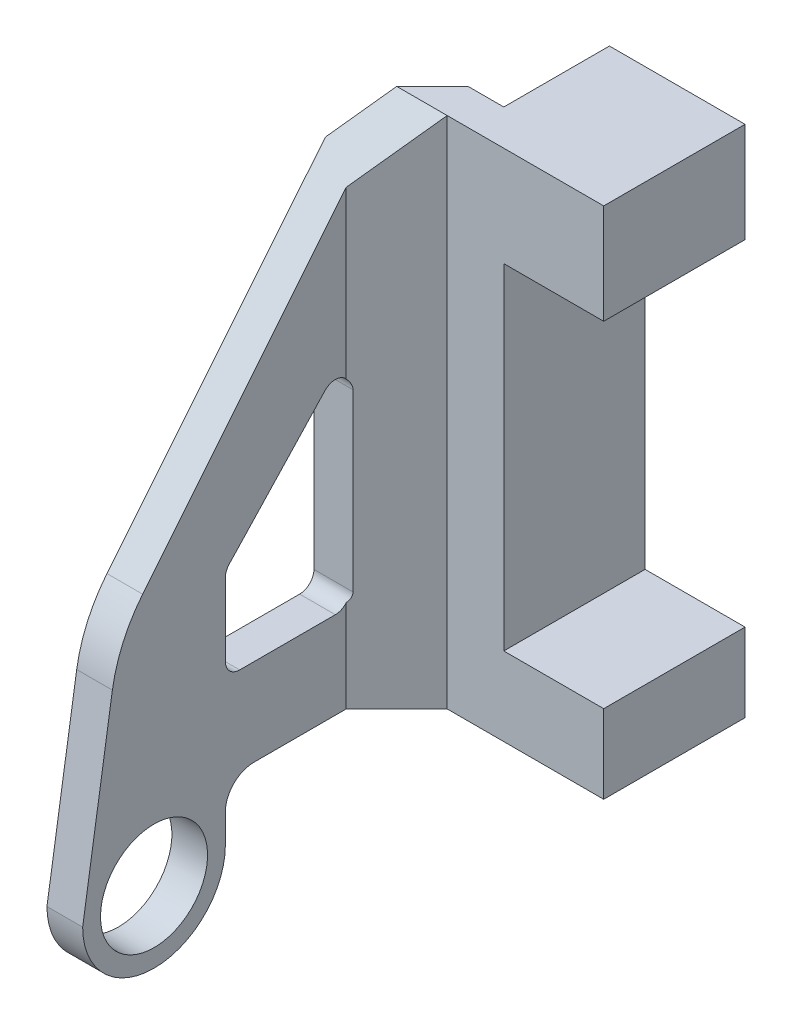
ISO-10303-21;
HEADER;
FILE_DESCRIPTION(('STEP AP214'),'2;1');
FILE_NAME('part.step','',(''),(''),'','','');
FILE_SCHEMA(('AUTOMOTIVE_DESIGN { 1 0 10303 214 1 1 1 1 }'));
ENDSEC;
DATA;
#1=APPLICATION_CONTEXT('core data for automotive mechanical design processes');
#2=APPLICATION_PROTOCOL_DEFINITION('international standard','automotive_design',2000,#1);
#3=PRODUCT_CONTEXT('',#1,'mechanical');
#4=PRODUCT('Part','Part','',(#3));
#5=PRODUCT_RELATED_PRODUCT_CATEGORY('part','',(#4));
#6=PRODUCT_DEFINITION_FORMATION('','',#4);
#7=PRODUCT_DEFINITION_CONTEXT('part definition',#1,'design');
#8=PRODUCT_DEFINITION('design','',#6,#7);
#9=PRODUCT_DEFINITION_SHAPE('','',#8);
#10=(LENGTH_UNIT() NAMED_UNIT(*) SI_UNIT(.MILLI.,.METRE.));
#11=(NAMED_UNIT(*) PLANE_ANGLE_UNIT() SI_UNIT($,.RADIAN.));
#12=(NAMED_UNIT(*) SI_UNIT($,.STERADIAN.) SOLID_ANGLE_UNIT());
#13=UNCERTAINTY_MEASURE_WITH_UNIT(LENGTH_MEASURE(1.E-05),#10,'distance_accuracy_value','');
#14=(GEOMETRIC_REPRESENTATION_CONTEXT(3) GLOBAL_UNCERTAINTY_ASSIGNED_CONTEXT((#13)) GLOBAL_UNIT_ASSIGNED_CONTEXT((#10,
#11,#12)) REPRESENTATION_CONTEXT('',''));
#15=CARTESIAN_POINT('',(0.,0.,0.));
#16=DIRECTION('',(0.,0.,1.));
#17=DIRECTION('',(1.,0.,0.));
#18=AXIS2_PLACEMENT_3D('',#15,#16,#17);
#19=CARTESIAN_POINT('',(-17.,-4.,26.9));
#20=DIRECTION('',(-1.,0.,0.));
#21=DIRECTION('',(0.,0.,1.));
#22=AXIS2_PLACEMENT_3D('',#19,#20,#21);
#23=PLANE('',#22);
#24=CARTESIAN_POINT('',(-17.,-4.,26.9));
#25=DIRECTION('',(-1.,0.,0.));
#26=DIRECTION('',(0.,0.,1.));
#27=AXIS2_PLACEMENT_3D('',#24,#25,#26);
#28=CIRCLE('',#27,3.75);
#29=CARTESIAN_POINT('',(-17.,-4.,30.65));
#30=VERTEX_POINT('',#29);
#31=EDGE_CURVE('E778',#30,#30,#28,.T.);
#32=ORIENTED_EDGE('',*,*,#31,.F.);
#33=EDGE_LOOP('',(#32));
#34=FACE_BOUND('',#33,.T.);
#35=DIRECTION('',(0.,0.988012033751101,-0.15437688027361));
#36=VECTOR('',#35,1.);
#37=CARTESIAN_POINT('',(-17.,-4.,31.9));
#38=LINE('',#37,#36);
#39=CARTESIAN_POINT('',(-17.,-4.,31.9));
#40=VERTEX_POINT('',#39);
#41=CARTESIAN_POINT('',(-17.,9.33291795760597,29.8167315691241));
#42=VERTEX_POINT('',#41);
#43=EDGE_CURVE('E314',#40,#42,#38,.T.);
#44=ORIENTED_EDGE('',*,*,#43,.T.);
#45=CARTESIAN_POINT('',(-17.,7.78914915486987,19.9366112316131));
#46=DIRECTION('',(-1.,0.,0.));
#47=DIRECTION('',(0.,0.,1.));
#48=AXIS2_PLACEMENT_3D('',#45,#46,#47);
#49=CIRCLE('',#48,10.);
#50=CARTESIAN_POINT('',(-17.,14.0950754058145,27.6977512327757));
#51=VERTEX_POINT('',#50);
#52=EDGE_CURVE('E369',#42,#51,#49,.T.);
#53=ORIENTED_EDGE('',*,*,#52,.T.);
#54=DIRECTION('',(0.,0.776114000116266,-0.630592625094466));
#55=VECTOR('',#54,1.);
#56=CARTESIAN_POINT('',(-17.,12.,29.4));
#57=LINE('',#56,#55);
#58=CARTESIAN_POINT('',(-17.,32.923076923077,12.3999999999999));
#59=VERTEX_POINT('',#58);
#60=EDGE_CURVE('E317',#51,#59,#57,.T.);
#61=ORIENTED_EDGE('',*,*,#60,.T.);
#62=DIRECTION('',(0.,1.,0.));
#63=VECTOR('',#62,1.);
#64=CARTESIAN_POINT('',(-17.,-4.,12.3999999999999));
#65=LINE('',#64,#63);
#66=CARTESIAN_POINT('',(-17.,0.,12.3999999999999));
#67=VERTEX_POINT('',#66);
#68=EDGE_CURVE('E301',#67,#59,#65,.T.);
#69=ORIENTED_EDGE('',*,*,#68,.F.);
#70=DIRECTION('',(0.,0.,1.));
#71=VECTOR('',#70,1.);
#72=CARTESIAN_POINT('',(-17.,0.,7.4));
#73=LINE('',#72,#71);
#74=CARTESIAN_POINT('',(-17.,0.,19.9));
#75=VERTEX_POINT('',#74);
#76=EDGE_CURVE('E308',#67,#75,#73,.T.);
#77=ORIENTED_EDGE('',*,*,#76,.T.);
#78=CARTESIAN_POINT('',(-17.,-2.,19.9));
#79=DIRECTION('',(-1.,0.,0.));
#80=DIRECTION('',(0.,0.,1.));
#81=AXIS2_PLACEMENT_3D('',#78,#79,#80);
#82=CIRCLE('',#81,2.);
#83=CARTESIAN_POINT('',(-17.,-2.,21.9));
#84=VERTEX_POINT('',#83);
#85=EDGE_CURVE('E11',#75,#84,#82,.F.);
#86=ORIENTED_EDGE('',*,*,#85,.T.);
#87=DIRECTION('',(0.,-1.,0.));
#88=VECTOR('',#87,1.);
#89=CARTESIAN_POINT('',(-17.,0.,21.9));
#90=LINE('',#89,#88);
#91=CARTESIAN_POINT('',(-17.,-4.,21.9));
#92=VERTEX_POINT('',#91);
#93=EDGE_CURVE('E310',#84,#92,#90,.T.);
#94=ORIENTED_EDGE('',*,*,#93,.T.);
#95=CARTESIAN_POINT('',(-17.,-4.,26.9));
#96=DIRECTION('',(-1.,0.,0.));
#97=DIRECTION('',(0.,0.,1.));
#98=AXIS2_PLACEMENT_3D('',#95,#96,#97);
#99=CIRCLE('',#98,5.);
#100=EDGE_CURVE('E312',#92,#40,#99,.T.);
#101=ORIENTED_EDGE('',*,*,#100,.T.);
#102=EDGE_LOOP('',(#44,#53,#61,#69,#77,#86,#94,#101));
#103=FACE_BOUND('',#102,.T.);
#104=CARTESIAN_POINT('',(-17.,19.3672423947041,14.2));
#105=DIRECTION('',(-1.,0.,0.));
#106=DIRECTION('',(0.,0.,1.));
#107=AXIS2_PLACEMENT_3D('',#104,#105,#106);
#108=CIRCLE('',#107,1.);
#109=CARTESIAN_POINT('',(-17.,20.0503995234798,14.9302714135189));
#110=VERTEX_POINT('',#109);
#111=CARTESIAN_POINT('',(-17.,19.3672423947041,13.2));
#112=VERTEX_POINT('',#111);
#113=EDGE_CURVE('E232',#110,#112,#108,.T.);
#114=ORIENTED_EDGE('',*,*,#113,.F.);
#115=DIRECTION('',(0.,-0.730271413518896,0.683157128775741));
#116=VECTOR('',#115,1.);
#117=CARTESIAN_POINT('',(-17.,16.8061598224195,17.965205327414));
#118=LINE('',#117,#116);
#119=CARTESIAN_POINT('',(-17.,12.8883305579626,21.6302714135189));
#120=VERTEX_POINT('',#119);
#121=EDGE_CURVE('E237',#110,#120,#118,.T.);
#122=ORIENTED_EDGE('',*,*,#121,.T.);
#123=CARTESIAN_POINT('',(-17.,12.2051734291868,20.9));
#124=DIRECTION('',(-1.,0.,0.));
#125=DIRECTION('',(0.,0.,1.));
#126=AXIS2_PLACEMENT_3D('',#123,#124,#125);
#127=CIRCLE('',#126,1.);
#128=CARTESIAN_POINT('',(-17.,12.2051734291868,21.9));
#129=VERTEX_POINT('',#128);
#130=EDGE_CURVE('E254',#129,#120,#127,.T.);
#131=ORIENTED_EDGE('',*,*,#130,.F.);
#132=DIRECTION('',(0.,-1.,0.));
#133=VECTOR('',#132,1.);
#134=CARTESIAN_POINT('',(-17.,0.,21.9));
#135=LINE('',#134,#133);
#136=CARTESIAN_POINT('',(-17.,7.1,21.9));
#137=VERTEX_POINT('',#136);
#138=EDGE_CURVE('E251',#129,#137,#135,.T.);
#139=ORIENTED_EDGE('',*,*,#138,.T.);
#140=CARTESIAN_POINT('',(-17.,7.1,20.9));
#141=DIRECTION('',(-1.,0.,0.));
#142=DIRECTION('',(0.,0.,1.));
#143=AXIS2_PLACEMENT_3D('',#140,#141,#142);
#144=CIRCLE('',#143,1.);
#145=CARTESIAN_POINT('',(-17.,6.1,20.9));
#146=VERTEX_POINT('',#145);
#147=EDGE_CURVE('E248',#146,#137,#144,.T.);
#148=ORIENTED_EDGE('',*,*,#147,.F.);
#149=DIRECTION('',(0.,0.,-1.));
#150=VECTOR('',#149,1.);
#151=CARTESIAN_POINT('',(-17.,6.1,0.));
#152=LINE('',#151,#150);
#153=CARTESIAN_POINT('',(-17.,6.09999999999999,14.2));
#154=VERTEX_POINT('',#153);
#155=EDGE_CURVE('E243',#146,#154,#152,.T.);
#156=ORIENTED_EDGE('',*,*,#155,.T.);
#157=CARTESIAN_POINT('',(-17.,7.1,14.2));
#158=DIRECTION('',(-1.,0.,0.));
#159=DIRECTION('',(0.,0.,1.));
#160=AXIS2_PLACEMENT_3D('',#157,#158,#159);
#161=CIRCLE('',#160,1.);
#162=CARTESIAN_POINT('',(-17.,7.1,13.2));
#163=VERTEX_POINT('',#162);
#164=EDGE_CURVE('E241',#163,#154,#161,.T.);
#165=ORIENTED_EDGE('',*,*,#164,.F.);
#166=DIRECTION('',(0.,1.,0.));
#167=VECTOR('',#166,1.);
#168=CARTESIAN_POINT('',(-17.,0.,13.2));
#169=LINE('',#168,#167);
#170=EDGE_CURVE('E221',#163,#112,#169,.T.);
#171=ORIENTED_EDGE('',*,*,#170,.T.);
#172=EDGE_LOOP('',(#114,#122,#131,#139,#148,#156,#165,#171));
#173=FACE_BOUND('',#172,.T.);
#174=ADVANCED_FACE('F34',(#34,#103,#173),#23,.T.);
#175=CARTESIAN_POINT('',(-9.5,36.,9.9));
#176=DIRECTION('',(1.,0.,0.));
#177=DIRECTION('',(0.,0.,-1.));
#178=AXIS2_PLACEMENT_3D('',#175,#176,#177);
#179=PLANE('',#178);
#180=DIRECTION('',(0.,-1.,0.));
#181=VECTOR('',#180,1.);
#182=CARTESIAN_POINT('',(-9.5,0.,7.4));
#183=LINE('',#182,#181);
#184=CARTESIAN_POINT('',(-9.5,36.,7.4));
#185=VERTEX_POINT('',#184);
#186=CARTESIAN_POINT('',(-9.5,0.,7.4));
#187=VERTEX_POINT('',#186);
#188=EDGE_CURVE('E307',#185,#187,#183,.T.);
#189=ORIENTED_EDGE('',*,*,#188,.F.);
#190=DIRECTION('',(0.,0.,-1.));
#191=VECTOR('',#190,1.);
#192=CARTESIAN_POINT('',(-9.5,36.,9.9));
#193=LINE('',#192,#191);
#194=CARTESIAN_POINT('',(-9.5,36.,0.));
#195=VERTEX_POINT('',#194);
#196=EDGE_CURVE('E447',#185,#195,#193,.T.);
#197=ORIENTED_EDGE('',*,*,#196,.T.);
#198=DIRECTION('',(0.,-1.,0.));
#199=VECTOR('',#198,1.);
#200=CARTESIAN_POINT('',(-9.5,36.,0.));
#201=LINE('',#200,#199);
#202=CARTESIAN_POINT('',(-9.5,0.,0.));
#203=VERTEX_POINT('',#202);
#204=EDGE_CURVE('E438',#195,#203,#201,.T.);
#205=ORIENTED_EDGE('',*,*,#204,.T.);
#206=DIRECTION('',(0.,0.,-1.));
#207=VECTOR('',#206,1.);
#208=CARTESIAN_POINT('',(-9.5,0.,9.9));
#209=LINE('',#208,#207);
#210=EDGE_CURVE('E428',#187,#203,#209,.T.);
#211=ORIENTED_EDGE('',*,*,#210,.F.);
#212=EDGE_LOOP('',(#189,#197,#205,#211));
#213=FACE_BOUND('',#212,.T.);
#214=ADVANCED_FACE('F480',(#213),#179,.F.);
#215=CARTESIAN_POINT('',(0.,0.,9.9));
#216=DIRECTION('',(-1.,0.,0.));
#217=DIRECTION('',(0.,-1.,0.));
#218=AXIS2_PLACEMENT_3D('',#215,#216,#217);
#219=PLANE('',#218);
#220=DIRECTION('',(0.,1.,0.));
#221=VECTOR('',#220,1.);
#222=CARTESIAN_POINT('',(0.,0.,0.));
#223=LINE('',#222,#221);
#224=CARTESIAN_POINT('',(0.,0.,0.));
#225=VERTEX_POINT('',#224);
#226=CARTESIAN_POINT('',(0.,5.5,0.));
#227=VERTEX_POINT('',#226);
#228=EDGE_CURVE('E432',#225,#227,#223,.T.);
#229=ORIENTED_EDGE('',*,*,#228,.T.);
#230=DIRECTION('',(0.,0.,1.));
#231=VECTOR('',#230,1.);
#232=CARTESIAN_POINT('',(0.,5.5,0.));
#233=LINE('',#232,#231);
#234=CARTESIAN_POINT('',(0.,5.5,9.9));
#235=VERTEX_POINT('',#234);
#236=EDGE_CURVE('E412',#227,#235,#233,.T.);
#237=ORIENTED_EDGE('',*,*,#236,.T.);
#238=DIRECTION('',(0.,1.,0.));
#239=VECTOR('',#238,1.);
#240=CARTESIAN_POINT('',(0.,0.,9.9));
#241=LINE('',#240,#239);
#242=CARTESIAN_POINT('',(0.,0.,9.9));
#243=VERTEX_POINT('',#242);
#244=EDGE_CURVE('E422',#243,#235,#241,.T.);
#245=ORIENTED_EDGE('',*,*,#244,.F.);
#246=DIRECTION('',(0.,0.,-1.));
#247=VECTOR('',#246,1.);
#248=CARTESIAN_POINT('',(0.,0.,9.9));
#249=LINE('',#248,#247);
#250=EDGE_CURVE('E448',#243,#225,#249,.T.);
#251=ORIENTED_EDGE('',*,*,#250,.T.);
#252=EDGE_LOOP('',(#229,#237,#245,#251));
#253=FACE_BOUND('',#252,.T.);
#254=ADVANCED_FACE('F511',(#253),#219,.F.);
#255=CARTESIAN_POINT('',(-9.5,0.,9.9));
#256=DIRECTION('',(0.,1.,0.));
#257=DIRECTION('',(0.,0.,1.));
#258=AXIS2_PLACEMENT_3D('',#255,#256,#257);
#259=PLANE('',#258);
#260=DIRECTION('',(0.,0.,1.));
#261=VECTOR('',#260,1.);
#262=CARTESIAN_POINT('',(-14.5,0.,9.9));
#263=LINE('',#262,#261);
#264=CARTESIAN_POINT('',(-14.5,0.,13.4355339059327));
#265=VERTEX_POINT('',#264);
#266=CARTESIAN_POINT('',(-14.5,0.,19.9));
#267=VERTEX_POINT('',#266);
#268=EDGE_CURVE('E291',#265,#267,#263,.T.);
#269=ORIENTED_EDGE('',*,*,#268,.T.);
#270=DIRECTION('',(1.,0.,0.));
#271=VECTOR('',#270,1.);
#272=CARTESIAN_POINT('',(-17.,0.,19.9));
#273=LINE('',#272,#271);
#274=EDGE_CURVE('E50',#267,#75,#273,.F.);
#275=ORIENTED_EDGE('',*,*,#274,.T.);
#276=ORIENTED_EDGE('',*,*,#76,.F.);
#277=DIRECTION('',(0.707106781186551,0.,-0.707106781186544));
#278=VECTOR('',#277,1.);
#279=CARTESIAN_POINT('',(-12.,0.,7.39999999999999));
#280=LINE('',#279,#278);
#281=CARTESIAN_POINT('',(-12.,0.,7.4));
#282=VERTEX_POINT('',#281);
#283=EDGE_CURVE('E304',#67,#282,#280,.T.);
#284=ORIENTED_EDGE('',*,*,#283,.T.);
#285=DIRECTION('',(1.,0.,0.));
#286=VECTOR('',#285,1.);
#287=CARTESIAN_POINT('',(-17.,0.,7.4));
#288=LINE('',#287,#286);
#289=EDGE_CURVE('E337',#282,#187,#288,.T.);
#290=ORIENTED_EDGE('',*,*,#289,.T.);
#291=ORIENTED_EDGE('',*,*,#210,.T.);
#292=DIRECTION('',(1.,0.,0.));
#293=VECTOR('',#292,1.);
#294=CARTESIAN_POINT('',(-9.5,0.,0.));
#295=LINE('',#294,#293);
#296=EDGE_CURVE('E415',#203,#225,#295,.T.);
#297=ORIENTED_EDGE('',*,*,#296,.T.);
#298=ORIENTED_EDGE('',*,*,#250,.F.);
#299=DIRECTION('',(1.,0.,0.));
#300=VECTOR('',#299,1.);
#301=CARTESIAN_POINT('',(-9.5,0.,9.9));
#302=LINE('',#301,#300);
#303=CARTESIAN_POINT('',(-10.9644660940673,0.,9.9));
#304=VERTEX_POINT('',#303);
#305=EDGE_CURVE('E332',#304,#243,#302,.T.);
#306=ORIENTED_EDGE('',*,*,#305,.F.);
#307=DIRECTION('',(-0.707106781186551,0.,0.707106781186544));
#308=VECTOR('',#307,1.);
#309=CARTESIAN_POINT('',(-10.2322330470336,0.,9.16776695296636));
#310=LINE('',#309,#308);
#311=EDGE_CURVE('E293',#304,#265,#310,.T.);
#312=ORIENTED_EDGE('',*,*,#311,.T.);
#313=EDGE_LOOP('',(#269,#275,#276,#284,#290,#291,#297,#298,#306,#312));
#314=FACE_BOUND('',#313,.T.);
#315=ADVANCED_FACE('F483',(#314),#259,.F.);
#316=CARTESIAN_POINT('',(0.,29.,9.9));
#317=VERTEX_POINT('',#316);
#318=CARTESIAN_POINT('',(0.,36.,9.9));
#319=VERTEX_POINT('',#318);
#320=EDGE_CURVE('E426',#317,#319,#241,.T.);
#321=ORIENTED_EDGE('',*,*,#320,.F.);
#322=DIRECTION('',(0.,0.,1.));
#323=VECTOR('',#322,1.);
#324=CARTESIAN_POINT('',(0.,29.,0.));
#325=LINE('',#324,#323);
#326=CARTESIAN_POINT('',(0.,29.,0.));
#327=VERTEX_POINT('',#326);
#328=EDGE_CURVE('E406',#327,#317,#325,.T.);
#329=ORIENTED_EDGE('',*,*,#328,.F.);
#330=CARTESIAN_POINT('',(0.,36.,0.));
#331=VERTEX_POINT('',#330);
#332=EDGE_CURVE('E431',#327,#331,#223,.T.);
#333=ORIENTED_EDGE('',*,*,#332,.T.);
#334=DIRECTION('',(0.,0.,-1.));
#335=VECTOR('',#334,1.);
#336=CARTESIAN_POINT('',(0.,36.,9.9));
#337=LINE('',#336,#335);
#338=EDGE_CURVE('E449',#319,#331,#337,.T.);
#339=ORIENTED_EDGE('',*,*,#338,.F.);
#340=EDGE_LOOP('',(#321,#329,#333,#339));
#341=FACE_BOUND('',#340,.T.);
#342=ADVANCED_FACE('F506',(#341),#219,.F.);
#343=CARTESIAN_POINT('',(0.,36.,9.9));
#344=DIRECTION('',(0.,-1.,0.));
#345=DIRECTION('',(0.,0.,-1.));
#346=AXIS2_PLACEMENT_3D('',#343,#344,#345);
#347=PLANE('',#346);
#348=DIRECTION('',(1.,0.,0.));
#349=VECTOR('',#348,1.);
#350=CARTESIAN_POINT('',(-17.,36.,7.4));
#351=LINE('',#350,#349);
#352=CARTESIAN_POINT('',(-12.,36.,7.4));
#353=VERTEX_POINT('',#352);
#354=EDGE_CURVE('E319',#353,#185,#351,.T.);
#355=ORIENTED_EDGE('',*,*,#354,.F.);
#356=DIRECTION('',(0.707106781186551,0.,-0.707106781186544));
#357=VECTOR('',#356,1.);
#358=CARTESIAN_POINT('',(-12.,36.,7.4));
#359=LINE('',#358,#357);
#360=CARTESIAN_POINT('',(-14.5,36.,9.9));
#361=VERTEX_POINT('',#360);
#362=EDGE_CURVE('E296',#361,#353,#359,.T.);
#363=ORIENTED_EDGE('',*,*,#362,.F.);
#364=DIRECTION('',(1.,0.,0.));
#365=VECTOR('',#364,1.);
#366=CARTESIAN_POINT('',(-17.,36.,9.9));
#367=LINE('',#366,#365);
#368=CARTESIAN_POINT('',(-10.9644660940673,36.,9.9));
#369=VERTEX_POINT('',#368);
#370=EDGE_CURVE('E322',#361,#369,#367,.T.);
#371=ORIENTED_EDGE('',*,*,#370,.T.);
#372=DIRECTION('',(-1.,0.,0.));
#373=VECTOR('',#372,1.);
#374=CARTESIAN_POINT('',(0.,36.,9.9));
#375=LINE('',#374,#373);
#376=EDGE_CURVE('E425',#319,#369,#375,.T.);
#377=ORIENTED_EDGE('',*,*,#376,.F.);
#378=ORIENTED_EDGE('',*,*,#338,.T.);
#379=DIRECTION('',(-1.,0.,0.));
#380=VECTOR('',#379,1.);
#381=CARTESIAN_POINT('',(0.,36.,0.));
#382=LINE('',#381,#380);
#383=EDGE_CURVE('E435',#331,#195,#382,.T.);
#384=ORIENTED_EDGE('',*,*,#383,.T.);
#385=ORIENTED_EDGE('',*,*,#196,.F.);
#386=EDGE_LOOP('',(#355,#363,#371,#377,#378,#384,#385));
#387=FACE_BOUND('',#386,.T.);
#388=ADVANCED_FACE('F475',(#387),#347,.F.);
#389=CARTESIAN_POINT('',(0.,0.,9.9));
#390=DIRECTION('',(0.,0.,1.));
#391=DIRECTION('',(1.,0.,0.));
#392=AXIS2_PLACEMENT_3D('',#389,#390,#391);
#393=PLANE('',#392);
#394=ORIENTED_EDGE('',*,*,#376,.T.);
#395=DIRECTION('',(0.,1.,0.));
#396=VECTOR('',#395,1.);
#397=CARTESIAN_POINT('',(-10.9644660940673,-101.5,9.9));
#398=LINE('',#397,#396);
#399=EDGE_CURVE('E274',#304,#369,#398,.T.);
#400=ORIENTED_EDGE('',*,*,#399,.F.);
#401=ORIENTED_EDGE('',*,*,#305,.T.);
#402=ORIENTED_EDGE('',*,*,#244,.T.);
#403=DIRECTION('',(1.,0.,0.));
#404=VECTOR('',#403,1.);
#405=CARTESIAN_POINT('',(-7.,5.5,9.9));
#406=LINE('',#405,#404);
#407=CARTESIAN_POINT('',(-7.,5.5,9.9));
#408=VERTEX_POINT('',#407);
#409=EDGE_CURVE('E400',#408,#235,#406,.T.);
#410=ORIENTED_EDGE('',*,*,#409,.F.);
#411=DIRECTION('',(0.,-1.,0.));
#412=VECTOR('',#411,1.);
#413=CARTESIAN_POINT('',(-7.,29.,9.9));
#414=LINE('',#413,#412);
#415=CARTESIAN_POINT('',(-7.,29.,9.9));
#416=VERTEX_POINT('',#415);
#417=EDGE_CURVE('E408',#416,#408,#414,.T.);
#418=ORIENTED_EDGE('',*,*,#417,.F.);
#419=DIRECTION('',(-1.,0.,0.));
#420=VECTOR('',#419,1.);
#421=CARTESIAN_POINT('',(0.,29.,9.9));
#422=LINE('',#421,#420);
#423=EDGE_CURVE('E394',#317,#416,#422,.T.);
#424=ORIENTED_EDGE('',*,*,#423,.F.);
#425=ORIENTED_EDGE('',*,*,#320,.T.);
#426=EDGE_LOOP('',(#394,#400,#401,#402,#410,#418,#424,#425));
#427=FACE_BOUND('',#426,.T.);
#428=ADVANCED_FACE('F500',(#427),#393,.T.);
#429=CARTESIAN_POINT('',(0.,0.,0.));
#430=DIRECTION('',(0.,0.,1.));
#431=DIRECTION('',(1.,0.,0.));
#432=AXIS2_PLACEMENT_3D('',#429,#430,#431);
#433=PLANE('',#432);
#434=DIRECTION('',(0.,-1.,0.));
#435=VECTOR('',#434,1.);
#436=CARTESIAN_POINT('',(-7.,29.,0.));
#437=LINE('',#436,#435);
#438=CARTESIAN_POINT('',(-7.,29.,0.));
#439=VERTEX_POINT('',#438);
#440=CARTESIAN_POINT('',(-7.,5.5,0.));
#441=VERTEX_POINT('',#440);
#442=EDGE_CURVE('E399',#439,#441,#437,.T.);
#443=ORIENTED_EDGE('',*,*,#442,.T.);
#444=DIRECTION('',(1.,0.,0.));
#445=VECTOR('',#444,1.);
#446=CARTESIAN_POINT('',(-7.,5.5,0.));
#447=LINE('',#446,#445);
#448=EDGE_CURVE('E403',#441,#227,#447,.T.);
#449=ORIENTED_EDGE('',*,*,#448,.T.);
#450=ORIENTED_EDGE('',*,*,#228,.F.);
#451=ORIENTED_EDGE('',*,*,#296,.F.);
#452=ORIENTED_EDGE('',*,*,#204,.F.);
#453=ORIENTED_EDGE('',*,*,#383,.F.);
#454=ORIENTED_EDGE('',*,*,#332,.F.);
#455=DIRECTION('',(-1.,0.,0.));
#456=VECTOR('',#455,1.);
#457=CARTESIAN_POINT('',(0.,29.,0.));
#458=LINE('',#457,#456);
#459=EDGE_CURVE('E396',#327,#439,#458,.T.);
#460=ORIENTED_EDGE('',*,*,#459,.T.);
#461=EDGE_LOOP('',(#443,#449,#450,#451,#452,#453,#454,#460));
#462=FACE_BOUND('',#461,.T.);
#463=ADVANCED_FACE('F509',(#462),#433,.F.);
#464=CARTESIAN_POINT('',(-7.,5.5,0.));
#465=DIRECTION('',(0.,-1.,0.));
#466=DIRECTION('',(0.,0.,-1.));
#467=AXIS2_PLACEMENT_3D('',#464,#465,#466);
#468=PLANE('',#467);
#469=ORIENTED_EDGE('',*,*,#409,.T.);
#470=ORIENTED_EDGE('',*,*,#236,.F.);
#471=ORIENTED_EDGE('',*,*,#448,.F.);
#472=DIRECTION('',(0.,0.,1.));
#473=VECTOR('',#472,1.);
#474=CARTESIAN_POINT('',(-7.,5.5,0.));
#475=LINE('',#474,#473);
#476=EDGE_CURVE('E416',#441,#408,#475,.T.);
#477=ORIENTED_EDGE('',*,*,#476,.T.);
#478=EDGE_LOOP('',(#469,#470,#471,#477));
#479=FACE_BOUND('',#478,.T.);
#480=ADVANCED_FACE('F514',(#479),#468,.F.);
#481=CARTESIAN_POINT('',(-7.,29.,0.));
#482=DIRECTION('',(-1.,0.,0.));
#483=DIRECTION('',(0.,-1.,0.));
#484=AXIS2_PLACEMENT_3D('',#481,#482,#483);
#485=PLANE('',#484);
#486=ORIENTED_EDGE('',*,*,#417,.T.);
#487=ORIENTED_EDGE('',*,*,#476,.F.);
#488=ORIENTED_EDGE('',*,*,#442,.F.);
#489=DIRECTION('',(0.,0.,1.));
#490=VECTOR('',#489,1.);
#491=CARTESIAN_POINT('',(-7.,29.,0.));
#492=LINE('',#491,#490);
#493=EDGE_CURVE('E418',#439,#416,#492,.T.);
#494=ORIENTED_EDGE('',*,*,#493,.T.);
#495=EDGE_LOOP('',(#486,#487,#488,#494));
#496=FACE_BOUND('',#495,.T.);
#497=ADVANCED_FACE('F516',(#496),#485,.F.);
#498=CARTESIAN_POINT('',(0.,29.,0.));
#499=DIRECTION('',(0.,1.,0.));
#500=DIRECTION('',(0.,0.,1.));
#501=AXIS2_PLACEMENT_3D('',#498,#499,#500);
#502=PLANE('',#501);
#503=ORIENTED_EDGE('',*,*,#423,.T.);
#504=ORIENTED_EDGE('',*,*,#493,.F.);
#505=ORIENTED_EDGE('',*,*,#459,.F.);
#506=ORIENTED_EDGE('',*,*,#328,.T.);
#507=EDGE_LOOP('',(#503,#504,#505,#506));
#508=FACE_BOUND('',#507,.T.);
#509=ADVANCED_FACE('F519',(#508),#502,.F.);
#510=CARTESIAN_POINT('',(-17.,0.,7.4));
#511=DIRECTION('',(0.,0.,1.));
#512=DIRECTION('',(1.,0.,0.));
#513=AXIS2_PLACEMENT_3D('',#510,#511,#512);
#514=PLANE('',#513);
#515=ORIENTED_EDGE('',*,*,#289,.F.);
#516=DIRECTION('',(0.,1.,0.));
#517=VECTOR('',#516,1.);
#518=CARTESIAN_POINT('',(-12.,-101.5,7.4));
#519=LINE('',#518,#517);
#520=EDGE_CURVE('E298',#282,#353,#519,.T.);
#521=ORIENTED_EDGE('',*,*,#520,.T.);
#522=ORIENTED_EDGE('',*,*,#354,.T.);
#523=ORIENTED_EDGE('',*,*,#188,.T.);
#524=EDGE_LOOP('',(#515,#521,#522,#523));
#525=FACE_BOUND('',#524,.T.);
#526=ADVANCED_FACE('F478',(#525),#514,.F.);
#527=CARTESIAN_POINT('',(-17.,0.,21.9));
#528=DIRECTION('',(0.,0.,1.));
#529=DIRECTION('',(1.,0.,0.));
#530=AXIS2_PLACEMENT_3D('',#527,#528,#529);
#531=PLANE('',#530);
#532=ORIENTED_EDGE('',*,*,#93,.F.);
#533=DIRECTION('',(1.,0.,0.));
#534=VECTOR('',#533,1.);
#535=CARTESIAN_POINT('',(-14.5,-2.,21.9));
#536=LINE('',#535,#534);
#537=CARTESIAN_POINT('',(-14.5,-2.,21.9));
#538=VERTEX_POINT('',#537);
#539=EDGE_CURVE('E371',#84,#538,#536,.T.);
#540=ORIENTED_EDGE('',*,*,#539,.T.);
#541=DIRECTION('',(0.,-1.,0.));
#542=VECTOR('',#541,1.);
#543=CARTESIAN_POINT('',(-14.5,0.,21.9));
#544=LINE('',#543,#542);
#545=CARTESIAN_POINT('',(-14.5,-4.,21.9));
#546=VERTEX_POINT('',#545);
#547=EDGE_CURVE('E289',#538,#546,#544,.T.);
#548=ORIENTED_EDGE('',*,*,#547,.T.);
#549=DIRECTION('',(1.,0.,0.));
#550=VECTOR('',#549,1.);
#551=CARTESIAN_POINT('',(-17.,-4.,21.9));
#552=LINE('',#551,#550);
#553=EDGE_CURVE('E390',#92,#546,#552,.T.);
#554=ORIENTED_EDGE('',*,*,#553,.F.);
#555=EDGE_LOOP('',(#532,#540,#548,#554));
#556=FACE_BOUND('',#555,.T.);
#557=ADVANCED_FACE('F378',(#556),#531,.F.);
#558=CARTESIAN_POINT('',(-17.,-4.,26.9));
#559=DIRECTION('',(1.,0.,0.));
#560=DIRECTION('',(0.,0.,-1.));
#561=AXIS2_PLACEMENT_3D('',#558,#559,#560);
#562=CYLINDRICAL_SURFACE('',#561,5.);
#563=ORIENTED_EDGE('',*,*,#553,.T.);
#564=CARTESIAN_POINT('',(-14.5,-4.,26.9));
#565=DIRECTION('',(-1.,0.,0.));
#566=DIRECTION('',(0.,0.,1.));
#567=AXIS2_PLACEMENT_3D('',#564,#565,#566);
#568=CIRCLE('',#567,5.);
#569=CARTESIAN_POINT('',(-14.5,-4.,31.9));
#570=VERTEX_POINT('',#569);
#571=EDGE_CURVE('E286',#546,#570,#568,.T.);
#572=ORIENTED_EDGE('',*,*,#571,.T.);
#573=DIRECTION('',(1.,0.,0.));
#574=VECTOR('',#573,1.);
#575=CARTESIAN_POINT('',(-17.,-4.,31.9));
#576=LINE('',#575,#574);
#577=EDGE_CURVE('E392',#40,#570,#576,.T.);
#578=ORIENTED_EDGE('',*,*,#577,.F.);
#579=ORIENTED_EDGE('',*,*,#100,.F.);
#580=EDGE_LOOP('',(#563,#572,#578,#579));
#581=FACE_BOUND('',#580,.T.);
#582=ADVANCED_FACE('F391',(#581),#562,.T.);
#583=CARTESIAN_POINT('',(-17.,-4.,31.9));
#584=DIRECTION('',(0.,-0.15437688027361,-0.988012033751101));
#585=DIRECTION('',(0.,0.988012033751101,-0.15437688027361));
#586=AXIS2_PLACEMENT_3D('',#583,#584,#585);
#587=PLANE('',#586);
#588=DIRECTION('',(0.,0.988012033751101,-0.15437688027361));
#589=VECTOR('',#588,1.);
#590=CARTESIAN_POINT('',(-14.5,-4.,31.9));
#591=LINE('',#590,#589);
#592=CARTESIAN_POINT('',(-14.5,9.33291795760597,29.8167315691241));
#593=VERTEX_POINT('',#592);
#594=EDGE_CURVE('E283',#570,#593,#591,.T.);
#595=ORIENTED_EDGE('',*,*,#594,.T.);
#596=DIRECTION('',(1.,0.,0.));
#597=VECTOR('',#596,1.);
#598=CARTESIAN_POINT('',(-17.,9.33291795760597,29.8167315691241));
#599=LINE('',#598,#597);
#600=EDGE_CURVE('E367',#593,#42,#599,.F.);
#601=ORIENTED_EDGE('',*,*,#600,.T.);
#602=ORIENTED_EDGE('',*,*,#43,.F.);
#603=ORIENTED_EDGE('',*,*,#577,.T.);
#604=EDGE_LOOP('',(#595,#601,#602,#603));
#605=FACE_BOUND('',#604,.T.);
#606=ADVANCED_FACE('F542',(#605),#587,.F.);
#607=CARTESIAN_POINT('',(-17.,36.,9.9));
#608=DIRECTION('',(0.,-0.630592625094466,-0.776114000116265));
#609=DIRECTION('',(0.,0.776114000116266,-0.630592625094466));
#610=AXIS2_PLACEMENT_3D('',#607,#608,#609);
#611=PLANE('',#610);
#612=ORIENTED_EDGE('',*,*,#60,.F.);
#613=DIRECTION('',(1.,0.,0.));
#614=VECTOR('',#613,1.);
#615=CARTESIAN_POINT('',(-17.,14.0950754058145,27.6977512327757));
#616=LINE('',#615,#614);
#617=CARTESIAN_POINT('',(-14.5,14.0950754058145,27.6977512327757));
#618=VERTEX_POINT('',#617);
#619=EDGE_CURVE('E362',#51,#618,#616,.T.);
#620=ORIENTED_EDGE('',*,*,#619,.T.);
#621=DIRECTION('',(0.,0.776114000116266,-0.630592625094466));
#622=VECTOR('',#621,1.);
#623=CARTESIAN_POINT('',(-14.5,36.,9.9));
#624=LINE('',#623,#622);
#625=CARTESIAN_POINT('',(-14.5,31.6485736542367,13.4355339059327));
#626=VERTEX_POINT('',#625);
#627=EDGE_CURVE('E278',#618,#626,#624,.T.);
#628=ORIENTED_EDGE('',*,*,#627,.T.);
#629=DIRECTION('',(0.533396460910446,0.656487951889773,-0.53339646091044));
#630=VECTOR('',#629,1.);
#631=CARTESIAN_POINT('',(-12.6816466161256,33.8865470497744,11.6171805220583));
#632=LINE('',#631,#630);
#633=EDGE_CURVE('E339',#626,#369,#632,.T.);
#634=ORIENTED_EDGE('',*,*,#633,.T.);
#635=ORIENTED_EDGE('',*,*,#370,.F.);
#636=DIRECTION('',(-0.533396460910446,-0.656487951889772,0.53339646091044));
#637=VECTOR('',#636,1.);
#638=CARTESIAN_POINT('',(-15.2112794612795,35.1245791245791,10.6112794612795));
#639=LINE('',#638,#637);
#640=EDGE_CURVE('E343',#361,#59,#639,.T.);
#641=ORIENTED_EDGE('',*,*,#640,.T.);
#642=EDGE_LOOP('',(#612,#620,#628,#634,#635,#641));
#643=FACE_BOUND('',#642,.T.);
#644=ADVANCED_FACE('F467',(#643),#611,.F.);
#645=CARTESIAN_POINT('',(-12.,-101.5,7.4));
#646=DIRECTION('',(0.707106781186544,0.,0.707106781186551));
#647=DIRECTION('',(0.707106781186551,0.,-0.707106781186544));
#648=AXIS2_PLACEMENT_3D('',#645,#646,#647);
#649=PLANE('',#648);
#650=ORIENTED_EDGE('',*,*,#68,.T.);
#651=ORIENTED_EDGE('',*,*,#640,.F.);
#652=ORIENTED_EDGE('',*,*,#362,.T.);
#653=ORIENTED_EDGE('',*,*,#520,.F.);
#654=ORIENTED_EDGE('',*,*,#283,.F.);
#655=EDGE_LOOP('',(#650,#651,#652,#653,#654));
#656=FACE_BOUND('',#655,.T.);
#657=ADVANCED_FACE('F472',(#656),#649,.F.);
#658=CARTESIAN_POINT('',(-10.9644660940673,-101.5,9.9));
#659=DIRECTION('',(-0.707106781186544,0.,-0.707106781186551));
#660=DIRECTION('',(-0.707106781186551,0.,0.707106781186544));
#661=AXIS2_PLACEMENT_3D('',#658,#659,#660);
#662=PLANE('',#661);
#663=DIRECTION('',(0.,1.,0.));
#664=VECTOR('',#663,1.);
#665=CARTESIAN_POINT('',(-14.2644660940673,-101.5,13.2));
#666=LINE('',#665,#664);
#667=CARTESIAN_POINT('',(-14.2644660940673,7.1,13.2));
#668=VERTEX_POINT('',#667);
#669=CARTESIAN_POINT('',(-14.2644660940673,19.3672423947041,13.2));
#670=VERTEX_POINT('',#669);
#671=EDGE_CURVE('E224',#668,#670,#666,.T.);
#672=ORIENTED_EDGE('',*,*,#671,.F.);
#673=CARTESIAN_POINT('',(-15.2644660940673,7.1,14.2));
#674=DIRECTION('',(-0.707106781186544,0.,-0.707106781186551));
#675=DIRECTION('',(-0.707106781186551,0.,0.707106781186544));
#676=AXIS2_PLACEMENT_3D('',#673,#674,#675);
#677=ELLIPSE('',#676,1.4142135623731,1.);
#678=CARTESIAN_POINT('',(-14.5,6.4553360635017,13.4355339059327));
#679=VERTEX_POINT('',#678);
#680=EDGE_CURVE('E271',#668,#679,#677,.T.);
#681=ORIENTED_EDGE('',*,*,#680,.T.);
#682=DIRECTION('',(0.,1.,0.));
#683=VECTOR('',#682,1.);
#684=CARTESIAN_POINT('',(-14.5,-101.5,13.4355339059327));
#685=LINE('',#684,#683);
#686=EDGE_CURVE('E275',#265,#679,#685,.T.);
#687=ORIENTED_EDGE('',*,*,#686,.F.);
#688=ORIENTED_EDGE('',*,*,#311,.F.);
#689=ORIENTED_EDGE('',*,*,#399,.T.);
#690=ORIENTED_EDGE('',*,*,#633,.F.);
#691=CARTESIAN_POINT('',(-14.5,20.0119063312024,13.4355339059327));
#692=VERTEX_POINT('',#691);
#693=EDGE_CURVE('E279',#692,#626,#685,.T.);
#694=ORIENTED_EDGE('',*,*,#693,.F.);
#695=CARTESIAN_POINT('',(-15.2644660940673,19.3672423947041,14.2));
#696=DIRECTION('',(-0.707106781186544,0.,-0.707106781186551));
#697=DIRECTION('',(-0.707106781186551,0.,0.707106781186544));
#698=AXIS2_PLACEMENT_3D('',#695,#696,#697);
#699=ELLIPSE('',#698,1.4142135623731,1.);
#700=EDGE_CURVE('E259',#692,#670,#699,.T.);
#701=ORIENTED_EDGE('',*,*,#700,.T.);
#702=EDGE_LOOP('',(#672,#681,#687,#688,#689,#690,#694,#701));
#703=FACE_BOUND('',#702,.T.);
#704=ADVANCED_FACE('F495',(#703),#662,.F.);
#705=CARTESIAN_POINT('',(-14.5,-101.5,13.4355339059327));
#706=DIRECTION('',(-1.,0.,0.));
#707=DIRECTION('',(0.,0.,1.));
#708=AXIS2_PLACEMENT_3D('',#705,#706,#707);
#709=PLANE('',#708);
#710=CARTESIAN_POINT('',(-14.5,-4.,26.9));
#711=DIRECTION('',(-1.,0.,0.));
#712=DIRECTION('',(0.,0.,1.));
#713=AXIS2_PLACEMENT_3D('',#710,#711,#712);
#714=CIRCLE('',#713,3.75);
#715=CARTESIAN_POINT('',(-14.5,-4.,30.65));
#716=VERTEX_POINT('',#715);
#717=EDGE_CURVE('E38',#716,#716,#714,.T.);
#718=ORIENTED_EDGE('',*,*,#717,.T.);
#719=EDGE_LOOP('',(#718));
#720=FACE_BOUND('',#719,.T.);
#721=ORIENTED_EDGE('',*,*,#627,.F.);
#722=CARTESIAN_POINT('',(-14.5,7.78914915486987,19.9366112316131));
#723=DIRECTION('',(-1.,0.,0.));
#724=DIRECTION('',(0.,0.,1.));
#725=AXIS2_PLACEMENT_3D('',#722,#723,#724);
#726=CIRCLE('',#725,10.);
#727=EDGE_CURVE('E365',#618,#593,#726,.F.);
#728=ORIENTED_EDGE('',*,*,#727,.T.);
#729=ORIENTED_EDGE('',*,*,#594,.F.);
#730=ORIENTED_EDGE('',*,*,#571,.F.);
#731=ORIENTED_EDGE('',*,*,#547,.F.);
#732=CARTESIAN_POINT('',(-14.5,-2.,19.9));
#733=DIRECTION('',(-1.,0.,0.));
#734=DIRECTION('',(0.,0.,1.));
#735=AXIS2_PLACEMENT_3D('',#732,#733,#734);
#736=CIRCLE('',#735,2.);
#737=EDGE_CURVE('E43',#538,#267,#736,.T.);
#738=ORIENTED_EDGE('',*,*,#737,.T.);
#739=ORIENTED_EDGE('',*,*,#268,.F.);
#740=ORIENTED_EDGE('',*,*,#686,.T.);
#741=CARTESIAN_POINT('',(-14.5,7.1,14.2));
#742=DIRECTION('',(-1.,0.,0.));
#743=DIRECTION('',(0.,0.,1.));
#744=AXIS2_PLACEMENT_3D('',#741,#742,#743);
#745=CIRCLE('',#744,1.);
#746=CARTESIAN_POINT('',(-14.5,6.09999999999999,14.2));
#747=VERTEX_POINT('',#746);
#748=EDGE_CURVE('E358',#679,#747,#745,.T.);
#749=ORIENTED_EDGE('',*,*,#748,.T.);
#750=DIRECTION('',(0.,0.,-1.));
#751=VECTOR('',#750,1.);
#752=CARTESIAN_POINT('',(-14.5,6.09999999999999,13.4355339059327));
#753=LINE('',#752,#751);
#754=CARTESIAN_POINT('',(-14.5,6.1,20.9));
#755=VERTEX_POINT('',#754);
#756=EDGE_CURVE('E356',#755,#747,#753,.T.);
#757=ORIENTED_EDGE('',*,*,#756,.F.);
#758=CARTESIAN_POINT('',(-14.5,7.1,20.9));
#759=DIRECTION('',(-1.,0.,0.));
#760=DIRECTION('',(0.,0.,1.));
#761=AXIS2_PLACEMENT_3D('',#758,#759,#760);
#762=CIRCLE('',#761,1.);
#763=CARTESIAN_POINT('',(-14.5,7.1,21.9));
#764=VERTEX_POINT('',#763);
#765=EDGE_CURVE('E353',#755,#764,#762,.T.);
#766=ORIENTED_EDGE('',*,*,#765,.T.);
#767=DIRECTION('',(0.,-1.,0.));
#768=VECTOR('',#767,1.);
#769=CARTESIAN_POINT('',(-14.5,-101.5,21.9));
#770=LINE('',#769,#768);
#771=CARTESIAN_POINT('',(-14.5,12.2051734291868,21.9));
#772=VERTEX_POINT('',#771);
#773=EDGE_CURVE('E351',#772,#764,#770,.T.);
#774=ORIENTED_EDGE('',*,*,#773,.F.);
#775=CARTESIAN_POINT('',(-14.5,12.2051734291868,20.9));
#776=DIRECTION('',(-1.,0.,0.));
#777=DIRECTION('',(0.,0.,1.));
#778=AXIS2_PLACEMENT_3D('',#775,#776,#777);
#779=CIRCLE('',#778,1.);
#780=CARTESIAN_POINT('',(-14.5,12.8883305579626,21.6302714135189));
#781=VERTEX_POINT('',#780);
#782=EDGE_CURVE('E348',#772,#781,#779,.T.);
#783=ORIENTED_EDGE('',*,*,#782,.T.);
#784=DIRECTION('',(0.,-0.730271413518896,0.683157128775741));
#785=VECTOR('',#784,1.);
#786=CARTESIAN_POINT('',(-14.5,-44.0262735746024,74.8729656020474));
#787=LINE('',#786,#785);
#788=CARTESIAN_POINT('',(-14.5,20.0503995234798,14.9302714135189));
#789=VERTEX_POINT('',#788);
#790=EDGE_CURVE('E346',#789,#781,#787,.T.);
#791=ORIENTED_EDGE('',*,*,#790,.F.);
#792=CARTESIAN_POINT('',(-14.5,19.3672423947041,14.2));
#793=DIRECTION('',(-1.,0.,0.));
#794=DIRECTION('',(0.,0.,1.));
#795=AXIS2_PLACEMENT_3D('',#792,#793,#794);
#796=CIRCLE('',#795,1.);
#797=EDGE_CURVE('E342',#789,#692,#796,.T.);
#798=ORIENTED_EDGE('',*,*,#797,.T.);
#799=ORIENTED_EDGE('',*,*,#693,.T.);
#800=EDGE_LOOP('',(#721,#728,#729,#730,#731,#738,#739,#740,#749,#757,#766,#774,#783,#791,#798,#799));
#801=FACE_BOUND('',#800,.T.);
#802=ADVANCED_FACE('F384',(#720,#801),#709,.F.);
#803=CARTESIAN_POINT('',(120.5,0.,13.2));
#804=DIRECTION('',(0.,0.,1.));
#805=DIRECTION('',(0.,-1.,0.));
#806=AXIS2_PLACEMENT_3D('',#803,#804,#805);
#807=PLANE('',#806);
#808=ORIENTED_EDGE('',*,*,#671,.T.);
#809=DIRECTION('',(-1.,0.,0.));
#810=VECTOR('',#809,1.);
#811=CARTESIAN_POINT('',(120.5,19.3672423947041,13.2));
#812=LINE('',#811,#810);
#813=EDGE_CURVE('E216',#670,#112,#812,.T.);
#814=ORIENTED_EDGE('',*,*,#813,.T.);
#815=ORIENTED_EDGE('',*,*,#170,.F.);
#816=DIRECTION('',(-1.,0.,0.));
#817=VECTOR('',#816,1.);
#818=CARTESIAN_POINT('',(120.5,7.1,13.2));
#819=LINE('',#818,#817);
#820=EDGE_CURVE('E227',#668,#163,#819,.T.);
#821=ORIENTED_EDGE('',*,*,#820,.F.);
#822=EDGE_LOOP('',(#808,#814,#815,#821));
#823=FACE_BOUND('',#822,.T.);
#824=ADVANCED_FACE('F218',(#823),#807,.T.);
#825=CARTESIAN_POINT('',(120.5,16.8061598224195,17.965205327414));
#826=DIRECTION('',(0.,-0.683157128775741,-0.730271413518896));
#827=DIRECTION('',(0.,0.730271413518896,-0.683157128775741));
#828=AXIS2_PLACEMENT_3D('',#825,#826,#827);
#829=PLANE('',#828);
#830=ORIENTED_EDGE('',*,*,#790,.T.);
#831=DIRECTION('',(-1.,0.,0.));
#832=VECTOR('',#831,1.);
#833=CARTESIAN_POINT('',(120.5,12.8883305579626,21.6302714135189));
#834=LINE('',#833,#832);
#835=EDGE_CURVE('E257',#781,#120,#834,.T.);
#836=ORIENTED_EDGE('',*,*,#835,.T.);
#837=ORIENTED_EDGE('',*,*,#121,.F.);
#838=DIRECTION('',(-1.,0.,0.));
#839=VECTOR('',#838,1.);
#840=CARTESIAN_POINT('',(120.5,20.0503995234798,14.9302714135189));
#841=LINE('',#840,#839);
#842=EDGE_CURVE('E228',#789,#110,#841,.T.);
#843=ORIENTED_EDGE('',*,*,#842,.F.);
#844=EDGE_LOOP('',(#830,#836,#837,#843));
#845=FACE_BOUND('',#844,.T.);
#846=ADVANCED_FACE('F580',(#845),#829,.T.);
#847=CARTESIAN_POINT('',(120.5,12.2051734291868,20.9));
#848=DIRECTION('',(-1.,0.,0.));
#849=DIRECTION('',(0.,0.,1.));
#850=AXIS2_PLACEMENT_3D('',#847,#848,#849);
#851=CYLINDRICAL_SURFACE('',#850,1.);
#852=DIRECTION('',(-1.,0.,0.));
#853=VECTOR('',#852,1.);
#854=CARTESIAN_POINT('',(120.5,12.2051734291868,21.9));
#855=LINE('',#854,#853);
#856=EDGE_CURVE('E260',#772,#129,#855,.T.);
#857=ORIENTED_EDGE('',*,*,#856,.T.);
#858=ORIENTED_EDGE('',*,*,#130,.T.);
#859=ORIENTED_EDGE('',*,*,#835,.F.);
#860=ORIENTED_EDGE('',*,*,#782,.F.);
#861=EDGE_LOOP('',(#857,#858,#859,#860));
#862=FACE_BOUND('',#861,.T.);
#863=ADVANCED_FACE('F583',(#862),#851,.F.);
#864=CARTESIAN_POINT('',(120.5,0.,21.9));
#865=DIRECTION('',(0.,0.,-1.));
#866=DIRECTION('',(0.,1.,0.));
#867=AXIS2_PLACEMENT_3D('',#864,#865,#866);
#868=PLANE('',#867);
#869=ORIENTED_EDGE('',*,*,#773,.T.);
#870=DIRECTION('',(-1.,0.,0.));
#871=VECTOR('',#870,1.);
#872=CARTESIAN_POINT('',(120.5,7.1,21.9));
#873=LINE('',#872,#871);
#874=EDGE_CURVE('E262',#764,#137,#873,.T.);
#875=ORIENTED_EDGE('',*,*,#874,.T.);
#876=ORIENTED_EDGE('',*,*,#138,.F.);
#877=ORIENTED_EDGE('',*,*,#856,.F.);
#878=EDGE_LOOP('',(#869,#875,#876,#877));
#879=FACE_BOUND('',#878,.T.);
#880=ADVANCED_FACE('F726',(#879),#868,.T.);
#881=CARTESIAN_POINT('',(120.5,7.1,20.9));
#882=DIRECTION('',(-1.,0.,0.));
#883=DIRECTION('',(0.,0.,1.));
#884=AXIS2_PLACEMENT_3D('',#881,#882,#883);
#885=CYLINDRICAL_SURFACE('',#884,1.);
#886=DIRECTION('',(-1.,0.,0.));
#887=VECTOR('',#886,1.);
#888=CARTESIAN_POINT('',(120.5,6.1,20.9));
#889=LINE('',#888,#887);
#890=EDGE_CURVE('E264',#755,#146,#889,.T.);
#891=ORIENTED_EDGE('',*,*,#890,.T.);
#892=ORIENTED_EDGE('',*,*,#147,.T.);
#893=ORIENTED_EDGE('',*,*,#874,.F.);
#894=ORIENTED_EDGE('',*,*,#765,.F.);
#895=EDGE_LOOP('',(#891,#892,#893,#894));
#896=FACE_BOUND('',#895,.T.);
#897=ADVANCED_FACE('F735',(#896),#885,.F.);
#898=CARTESIAN_POINT('',(120.5,6.1,0.));
#899=DIRECTION('',(0.,1.,0.));
#900=DIRECTION('',(0.,0.,1.));
#901=AXIS2_PLACEMENT_3D('',#898,#899,#900);
#902=PLANE('',#901);
#903=ORIENTED_EDGE('',*,*,#756,.T.);
#904=DIRECTION('',(-1.,0.,0.));
#905=VECTOR('',#904,1.);
#906=CARTESIAN_POINT('',(120.5,6.09999999999999,14.2));
#907=LINE('',#906,#905);
#908=EDGE_CURVE('E266',#747,#154,#907,.T.);
#909=ORIENTED_EDGE('',*,*,#908,.T.);
#910=ORIENTED_EDGE('',*,*,#155,.F.);
#911=ORIENTED_EDGE('',*,*,#890,.F.);
#912=EDGE_LOOP('',(#903,#909,#910,#911));
#913=FACE_BOUND('',#912,.T.);
#914=ADVANCED_FACE('F575',(#913),#902,.T.);
#915=CARTESIAN_POINT('',(120.5,7.1,14.2));
#916=DIRECTION('',(-1.,0.,0.));
#917=DIRECTION('',(0.,0.,1.));
#918=AXIS2_PLACEMENT_3D('',#915,#916,#917);
#919=CYLINDRICAL_SURFACE('',#918,1.);
#920=ORIENTED_EDGE('',*,*,#820,.T.);
#921=ORIENTED_EDGE('',*,*,#164,.T.);
#922=ORIENTED_EDGE('',*,*,#908,.F.);
#923=ORIENTED_EDGE('',*,*,#748,.F.);
#924=ORIENTED_EDGE('',*,*,#680,.F.);
#925=EDGE_LOOP('',(#920,#921,#922,#923,#924));
#926=FACE_BOUND('',#925,.T.);
#927=ADVANCED_FACE('F570',(#926),#919,.F.);
#928=CARTESIAN_POINT('',(120.5,19.3672423947041,14.2));
#929=DIRECTION('',(-1.,0.,0.));
#930=DIRECTION('',(0.,0.,1.));
#931=AXIS2_PLACEMENT_3D('',#928,#929,#930);
#932=CYLINDRICAL_SURFACE('',#931,1.);
#933=ORIENTED_EDGE('',*,*,#797,.F.);
#934=ORIENTED_EDGE('',*,*,#842,.T.);
#935=ORIENTED_EDGE('',*,*,#113,.T.);
#936=ORIENTED_EDGE('',*,*,#813,.F.);
#937=ORIENTED_EDGE('',*,*,#700,.F.);
#938=EDGE_LOOP('',(#933,#934,#935,#936,#937));
#939=FACE_BOUND('',#938,.T.);
#940=ADVANCED_FACE('F233',(#939),#932,.F.);
#941=CARTESIAN_POINT('',(-17.,7.78914915486987,19.9366112316131));
#942=DIRECTION('',(1.,0.,0.));
#943=DIRECTION('',(0.,0.,-1.));
#944=AXIS2_PLACEMENT_3D('',#941,#942,#943);
#945=CYLINDRICAL_SURFACE('',#944,10.);
#946=ORIENTED_EDGE('',*,*,#52,.F.);
#947=ORIENTED_EDGE('',*,*,#600,.F.);
#948=ORIENTED_EDGE('',*,*,#727,.F.);
#949=ORIENTED_EDGE('',*,*,#619,.F.);
#950=EDGE_LOOP('',(#946,#947,#948,#949));
#951=FACE_BOUND('',#950,.T.);
#952=ADVANCED_FACE('F489',(#951),#945,.T.);
#953=CARTESIAN_POINT('',(-17.,-2.,19.9));
#954=DIRECTION('',(-1.,0.,0.));
#955=DIRECTION('',(0.,0.,1.));
#956=AXIS2_PLACEMENT_3D('',#953,#954,#955);
#957=CYLINDRICAL_SURFACE('',#956,2.);
#958=ORIENTED_EDGE('',*,*,#85,.F.);
#959=ORIENTED_EDGE('',*,*,#274,.F.);
#960=ORIENTED_EDGE('',*,*,#737,.F.);
#961=ORIENTED_EDGE('',*,*,#539,.F.);
#962=EDGE_LOOP('',(#958,#959,#960,#961));
#963=FACE_BOUND('',#962,.T.);
#964=ADVANCED_FACE('F36',(#963),#957,.F.);
#965=CARTESIAN_POINT('',(-7.,-4.,26.9));
#966=DIRECTION('',(-1.,0.,0.));
#967=DIRECTION('',(0.,0.,1.));
#968=AXIS2_PLACEMENT_3D('',#965,#966,#967);
#969=CYLINDRICAL_SURFACE('',#968,3.75);
#970=ORIENTED_EDGE('',*,*,#31,.T.);
#971=EDGE_LOOP('',(#970));
#972=FACE_BOUND('',#971,.T.);
#973=ORIENTED_EDGE('',*,*,#717,.F.);
#974=EDGE_LOOP('',(#973));
#975=FACE_BOUND('',#974,.T.);
#976=ADVANCED_FACE('F569',(#972,#975),#969,.F.);
#977=CLOSED_SHELL('',(#174,#214,#254,#315,#342,#388,#428,#463,#480,#497,#509,#526,#557,#582,
#606,#644,#657,#704,#802,#824,#846,#863,#880,#897,#914,#927,#940,#952,#964,#976));
#978=MANIFOLD_SOLID_BREP('B2',#977);
#979=ADVANCED_BREP_SHAPE_REPRESENTATION('',(#18,#978),#14);
#980=SHAPE_DEFINITION_REPRESENTATION(#9,#979);
ENDSEC;
END-ISO-10303-21;
